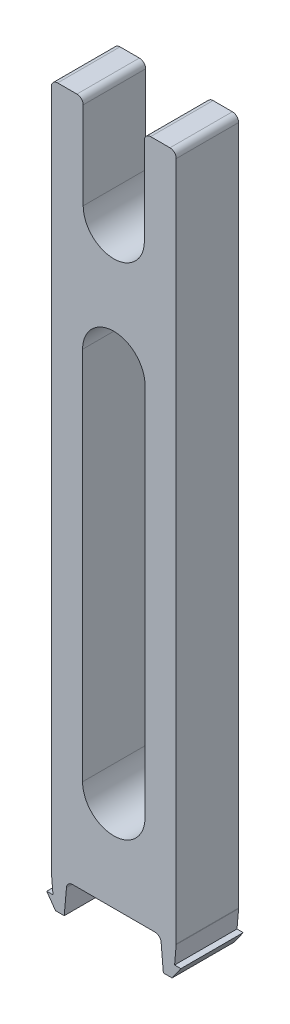
ISO-10303-21;
HEADER;
FILE_DESCRIPTION(('STEP AP214'),'2;1');
FILE_NAME('part.step','',(''),(''),'','','');
FILE_SCHEMA(('AUTOMOTIVE_DESIGN { 1 0 10303 214 1 1 1 1 }'));
ENDSEC;
DATA;
#1=APPLICATION_CONTEXT('core data for automotive mechanical design processes');
#2=APPLICATION_PROTOCOL_DEFINITION('international standard','automotive_design',2000,#1);
#3=PRODUCT_CONTEXT('',#1,'mechanical');
#4=PRODUCT('Part','Part','',(#3));
#5=PRODUCT_RELATED_PRODUCT_CATEGORY('part','',(#4));
#6=PRODUCT_DEFINITION_FORMATION('','',#4);
#7=PRODUCT_DEFINITION_CONTEXT('part definition',#1,'design');
#8=PRODUCT_DEFINITION('design','',#6,#7);
#9=PRODUCT_DEFINITION_SHAPE('','',#8);
#10=(LENGTH_UNIT() NAMED_UNIT(*) SI_UNIT(.MILLI.,.METRE.));
#11=(NAMED_UNIT(*) PLANE_ANGLE_UNIT() SI_UNIT($,.RADIAN.));
#12=(NAMED_UNIT(*) SI_UNIT($,.STERADIAN.) SOLID_ANGLE_UNIT());
#13=UNCERTAINTY_MEASURE_WITH_UNIT(LENGTH_MEASURE(1.E-05),#10,'distance_accuracy_value','');
#14=(GEOMETRIC_REPRESENTATION_CONTEXT(3) GLOBAL_UNCERTAINTY_ASSIGNED_CONTEXT((#13)) GLOBAL_UNIT_ASSIGNED_CONTEXT((#10,
#11,#12)) REPRESENTATION_CONTEXT('',''));
#15=CARTESIAN_POINT('',(0.,0.,0.));
#16=DIRECTION('',(0.,0.,1.));
#17=DIRECTION('',(1.,0.,0.));
#18=AXIS2_PLACEMENT_3D('',#15,#16,#17);
#19=CARTESIAN_POINT('',(0.,0.,0.));
#20=DIRECTION('',(0.,1.,0.));
#21=DIRECTION('',(0.,0.,1.));
#22=AXIS2_PLACEMENT_3D('',#19,#20,#21);
#23=PLANE('',#22);
#24=DIRECTION('',(-1.,0.,0.));
#25=VECTOR('',#24,1.);
#26=CARTESIAN_POINT('',(10.,0.,-5.));
#27=LINE('',#26,#25);
#28=CARTESIAN_POINT('',(6.58366882598258,0.,-5.));
#29=VERTEX_POINT('',#28);
#30=CARTESIAN_POINT('',(-6.58366882598258,0.,-5.));
#31=VERTEX_POINT('',#30);
#32=EDGE_CURVE('E374',#29,#31,#27,.T.);
#33=ORIENTED_EDGE('',*,*,#32,.F.);
#34=DIRECTION('',(0.,0.,1.));
#35=VECTOR('',#34,1.);
#36=CARTESIAN_POINT('',(6.58366882598258,0.,5.));
#37=LINE('',#36,#35);
#38=CARTESIAN_POINT('',(6.58366882598258,0.,5.));
#39=VERTEX_POINT('',#38);
#40=EDGE_CURVE('E422',#29,#39,#37,.T.);
#41=ORIENTED_EDGE('',*,*,#40,.T.);
#42=DIRECTION('',(1.,0.,0.));
#43=VECTOR('',#42,1.);
#44=CARTESIAN_POINT('',(10.,0.,5.));
#45=LINE('',#44,#43);
#46=CARTESIAN_POINT('',(-6.58366882598258,0.,5.));
#47=VERTEX_POINT('',#46);
#48=EDGE_CURVE('E364',#47,#39,#45,.T.);
#49=ORIENTED_EDGE('',*,*,#48,.F.);
#50=DIRECTION('',(0.,0.,1.));
#51=VECTOR('',#50,1.);
#52=CARTESIAN_POINT('',(-6.58366882598258,0.,0.));
#53=LINE('',#52,#51);
#54=EDGE_CURVE('E420',#47,#31,#53,.F.);
#55=ORIENTED_EDGE('',*,*,#54,.T.);
#56=EDGE_LOOP('',(#33,#41,#49,#55));
#57=FACE_BOUND('',#56,.T.);
#58=ADVANCED_FACE('F44',(#57),#23,.F.);
#59=CARTESIAN_POINT('',(0.,110.,0.));
#60=DIRECTION('',(0.,1.,0.));
#61=DIRECTION('',(0.,0.,1.));
#62=AXIS2_PLACEMENT_3D('',#59,#60,#61);
#63=PLANE('',#62);
#64=DIRECTION('',(1.,0.,0.));
#65=VECTOR('',#64,1.);
#66=CARTESIAN_POINT('',(10.,110.,5.));
#67=LINE('',#66,#65);
#68=CARTESIAN_POINT('',(5.9,110.,5.));
#69=VERTEX_POINT('',#68);
#70=CARTESIAN_POINT('',(9.00000000000001,110.,5.));
#71=VERTEX_POINT('',#70);
#72=EDGE_CURVE('E369',#69,#71,#67,.T.);
#73=ORIENTED_EDGE('',*,*,#72,.T.);
#74=DIRECTION('',(0.,0.,-1.));
#75=VECTOR('',#74,1.);
#76=CARTESIAN_POINT('',(9.00000000000001,110.,-5.));
#77=LINE('',#76,#75);
#78=CARTESIAN_POINT('',(9.00000000000001,110.,-5.));
#79=VERTEX_POINT('',#78);
#80=EDGE_CURVE('E439',#71,#79,#77,.T.);
#81=ORIENTED_EDGE('',*,*,#80,.T.);
#82=DIRECTION('',(-1.,0.,0.));
#83=VECTOR('',#82,1.);
#84=CARTESIAN_POINT('',(10.,110.,-5.));
#85=LINE('',#84,#83);
#86=CARTESIAN_POINT('',(5.9,110.,-5.));
#87=VERTEX_POINT('',#86);
#88=EDGE_CURVE('E372',#79,#87,#85,.T.);
#89=ORIENTED_EDGE('',*,*,#88,.T.);
#90=DIRECTION('',(0.,0.,1.));
#91=VECTOR('',#90,1.);
#92=CARTESIAN_POINT('',(5.9,110.,5.));
#93=LINE('',#92,#91);
#94=EDGE_CURVE('E436',#87,#69,#93,.T.);
#95=ORIENTED_EDGE('',*,*,#94,.T.);
#96=EDGE_LOOP('',(#73,#81,#89,#95));
#97=FACE_BOUND('',#96,.T.);
#98=ADVANCED_FACE('F534',(#97),#63,.T.);
#99=CARTESIAN_POINT('',(-10.,110.,5.));
#100=DIRECTION('',(1.,0.,0.));
#101=DIRECTION('',(0.,0.,-1.));
#102=AXIS2_PLACEMENT_3D('',#99,#100,#101);
#103=PLANE('',#102);
#104=DIRECTION('',(0.,-1.,0.));
#105=VECTOR('',#104,1.);
#106=CARTESIAN_POINT('',(-10.,110.,-5.));
#107=LINE('',#106,#105);
#108=CARTESIAN_POINT('',(-10.,109.,-5.));
#109=VERTEX_POINT('',#108);
#110=CARTESIAN_POINT('',(-10.,0.0436609429084883,-5.));
#111=VERTEX_POINT('',#110);
#112=EDGE_CURVE('E377',#109,#111,#107,.T.);
#113=ORIENTED_EDGE('',*,*,#112,.T.);
#114=DIRECTION('',(0.,0.,1.));
#115=VECTOR('',#114,1.);
#116=CARTESIAN_POINT('',(-10.,0.0436609429084883,5.));
#117=LINE('',#116,#115);
#118=CARTESIAN_POINT('',(-10.,0.0436609429084883,5.));
#119=VERTEX_POINT('',#118);
#120=EDGE_CURVE('E431',#111,#119,#117,.T.);
#121=ORIENTED_EDGE('',*,*,#120,.T.);
#122=DIRECTION('',(0.,-1.,0.));
#123=VECTOR('',#122,1.);
#124=CARTESIAN_POINT('',(-10.,110.,5.));
#125=LINE('',#124,#123);
#126=CARTESIAN_POINT('',(-10.,109.,5.));
#127=VERTEX_POINT('',#126);
#128=EDGE_CURVE('E386',#127,#119,#125,.T.);
#129=ORIENTED_EDGE('',*,*,#128,.F.);
#130=DIRECTION('',(0.,0.,1.));
#131=VECTOR('',#130,1.);
#132=CARTESIAN_POINT('',(-10.,109.,-5.));
#133=LINE('',#132,#131);
#134=EDGE_CURVE('E429',#127,#109,#133,.F.);
#135=ORIENTED_EDGE('',*,*,#134,.T.);
#136=EDGE_LOOP('',(#113,#121,#129,#135));
#137=FACE_BOUND('',#136,.T.);
#138=ADVANCED_FACE('F496',(#137),#103,.F.);
#139=CARTESIAN_POINT('',(10.,110.,5.));
#140=DIRECTION('',(0.,0.,-1.));
#141=DIRECTION('',(-1.,0.,0.));
#142=AXIS2_PLACEMENT_3D('',#139,#140,#141);
#143=PLANE('',#142);
#144=DIRECTION('',(0.,1.,0.));
#145=VECTOR('',#144,1.);
#146=CARTESIAN_POINT('',(5.,0.,5.));
#147=LINE('',#146,#145);
#148=CARTESIAN_POINT('',(5.,15.05,5.));
#149=VERTEX_POINT('',#148);
#150=CARTESIAN_POINT('',(5.,75.05,5.));
#151=VERTEX_POINT('',#150);
#152=EDGE_CURVE('E326',#149,#151,#147,.T.);
#153=ORIENTED_EDGE('',*,*,#152,.F.);
#154=CARTESIAN_POINT('',(0.,15.05,5.));
#155=DIRECTION('',(0.,0.,1.));
#156=DIRECTION('',(1.,0.,0.));
#157=AXIS2_PLACEMENT_3D('',#154,#155,#156);
#158=CIRCLE('',#157,5.);
#159=CARTESIAN_POINT('',(-5.,15.05,5.));
#160=VERTEX_POINT('',#159);
#161=EDGE_CURVE('E292',#160,#149,#158,.T.);
#162=ORIENTED_EDGE('',*,*,#161,.F.);
#163=DIRECTION('',(0.,1.,0.));
#164=VECTOR('',#163,1.);
#165=CARTESIAN_POINT('',(-5.,0.,5.));
#166=LINE('',#165,#164);
#167=CARTESIAN_POINT('',(-5.,75.05,5.));
#168=VERTEX_POINT('',#167);
#169=EDGE_CURVE('E332',#160,#168,#166,.T.);
#170=ORIENTED_EDGE('',*,*,#169,.T.);
#171=CARTESIAN_POINT('',(0.,75.05,5.));
#172=DIRECTION('',(0.,0.,1.));
#173=DIRECTION('',(1.,0.,0.));
#174=AXIS2_PLACEMENT_3D('',#171,#172,#173);
#175=CIRCLE('',#174,5.);
#176=EDGE_CURVE('E329',#168,#151,#175,.F.);
#177=ORIENTED_EDGE('',*,*,#176,.T.);
#178=EDGE_LOOP('',(#153,#162,#170,#177));
#179=FACE_BOUND('',#178,.T.);
#180=DIRECTION('',(-0.0871557427476617,-0.996194698091745,0.));
#181=VECTOR('',#180,1.);
#182=CARTESIAN_POINT('',(9.73753400942222,-3.,5.));
#183=LINE('',#182,#181);
#184=CARTESIAN_POINT('',(9.99619469809175,-0.0434947998390902,5.));
#185=VERTEX_POINT('',#184);
#186=CARTESIAN_POINT('',(9.73753400942222,-3.,5.));
#187=VERTEX_POINT('',#186);
#188=EDGE_CURVE('E250',#185,#187,#183,.T.);
#189=ORIENTED_EDGE('',*,*,#188,.F.);
#190=CARTESIAN_POINT('',(9.00000000000001,0.0436609429085716,5.));
#191=DIRECTION('',(0.,0.,-1.));
#192=DIRECTION('',(-1.,0.,0.));
#193=AXIS2_PLACEMENT_3D('',#190,#191,#192);
#194=CIRCLE('',#193,1.);
#195=CARTESIAN_POINT('',(10.,0.0436609429085716,5.));
#196=VERTEX_POINT('',#195);
#197=EDGE_CURVE('E418',#185,#196,#194,.F.);
#198=ORIENTED_EDGE('',*,*,#197,.T.);
#199=DIRECTION('',(0.,-1.,0.));
#200=VECTOR('',#199,1.);
#201=CARTESIAN_POINT('',(10.,110.,5.));
#202=LINE('',#201,#200);
#203=CARTESIAN_POINT('',(10.,109.,5.));
#204=VERTEX_POINT('',#203);
#205=EDGE_CURVE('E383',#204,#196,#202,.T.);
#206=ORIENTED_EDGE('',*,*,#205,.F.);
#207=CARTESIAN_POINT('',(9.00000000000001,109.,5.));
#208=DIRECTION('',(0.,0.,-1.));
#209=DIRECTION('',(-1.,0.,0.));
#210=AXIS2_PLACEMENT_3D('',#207,#208,#209);
#211=CIRCLE('',#210,1.);
#212=EDGE_CURVE('E414',#204,#71,#211,.F.);
#213=ORIENTED_EDGE('',*,*,#212,.T.);
#214=ORIENTED_EDGE('',*,*,#72,.F.);
#215=CARTESIAN_POINT('',(5.9,109.,5.));
#216=DIRECTION('',(0.,0.,-1.));
#217=DIRECTION('',(-1.,0.,0.));
#218=AXIS2_PLACEMENT_3D('',#215,#216,#217);
#219=CIRCLE('',#218,1.);
#220=CARTESIAN_POINT('',(4.9,109.,5.));
#221=VERTEX_POINT('',#220);
#222=EDGE_CURVE('E412',#69,#221,#219,.F.);
#223=ORIENTED_EDGE('',*,*,#222,.T.);
#224=DIRECTION('',(0.,1.,0.));
#225=VECTOR('',#224,1.);
#226=CARTESIAN_POINT('',(4.90000000000001,95.,5.));
#227=LINE('',#226,#225);
#228=CARTESIAN_POINT('',(4.90000000000001,95.,5.));
#229=VERTEX_POINT('',#228);
#230=EDGE_CURVE('E355',#229,#221,#227,.T.);
#231=ORIENTED_EDGE('',*,*,#230,.F.);
#232=CARTESIAN_POINT('',(0.,95.,5.));
#233=DIRECTION('',(0.,0.,1.));
#234=DIRECTION('',(1.,0.,0.));
#235=AXIS2_PLACEMENT_3D('',#232,#233,#234);
#236=CIRCLE('',#235,4.9);
#237=CARTESIAN_POINT('',(-4.89999999999999,95.,5.));
#238=VERTEX_POINT('',#237);
#239=EDGE_CURVE('E352',#238,#229,#236,.T.);
#240=ORIENTED_EDGE('',*,*,#239,.F.);
#241=DIRECTION('',(0.,-1.,0.));
#242=VECTOR('',#241,1.);
#243=CARTESIAN_POINT('',(-4.9,110.,5.));
#244=LINE('',#243,#242);
#245=CARTESIAN_POINT('',(-4.9,109.,5.));
#246=VERTEX_POINT('',#245);
#247=EDGE_CURVE('E344',#246,#238,#244,.T.);
#248=ORIENTED_EDGE('',*,*,#247,.F.);
#249=CARTESIAN_POINT('',(-5.9,109.,5.));
#250=DIRECTION('',(0.,0.,-1.));
#251=DIRECTION('',(-1.,0.,0.));
#252=AXIS2_PLACEMENT_3D('',#249,#250,#251);
#253=CIRCLE('',#252,1.);
#254=CARTESIAN_POINT('',(-5.9,110.,5.));
#255=VERTEX_POINT('',#254);
#256=EDGE_CURVE('E410',#246,#255,#253,.F.);
#257=ORIENTED_EDGE('',*,*,#256,.T.);
#258=CARTESIAN_POINT('',(-9.,110.,5.));
#259=VERTEX_POINT('',#258);
#260=EDGE_CURVE('E365',#259,#255,#67,.T.);
#261=ORIENTED_EDGE('',*,*,#260,.F.);
#262=CARTESIAN_POINT('',(-9.,109.,5.));
#263=DIRECTION('',(0.,0.,-1.));
#264=DIRECTION('',(-1.,0.,0.));
#265=AXIS2_PLACEMENT_3D('',#262,#263,#264);
#266=CIRCLE('',#265,1.);
#267=EDGE_CURVE('E408',#259,#127,#266,.F.);
#268=ORIENTED_EDGE('',*,*,#267,.T.);
#269=ORIENTED_EDGE('',*,*,#128,.T.);
#270=CARTESIAN_POINT('',(-9.,0.0436609429084883,5.));
#271=DIRECTION('',(0.,0.,-1.));
#272=DIRECTION('',(-1.,0.,0.));
#273=AXIS2_PLACEMENT_3D('',#270,#271,#272);
#274=CIRCLE('',#273,1.);
#275=CARTESIAN_POINT('',(-9.99619469809174,-0.0434947998391739,5.));
#276=VERTEX_POINT('',#275);
#277=EDGE_CURVE('E416',#119,#276,#274,.F.);
#278=ORIENTED_EDGE('',*,*,#277,.T.);
#279=DIRECTION('',(0.0871557427476617,-0.996194698091745,0.));
#280=VECTOR('',#279,1.);
#281=CARTESIAN_POINT('',(-9.73753400942222,-3.,5.));
#282=LINE('',#281,#280);
#283=CARTESIAN_POINT('',(-9.73753400942222,-3.,5.));
#284=VERTEX_POINT('',#283);
#285=EDGE_CURVE('E296',#276,#284,#282,.T.);
#286=ORIENTED_EDGE('',*,*,#285,.T.);
#287=DIRECTION('',(-1.,0.,0.));
#288=VECTOR('',#287,1.);
#289=CARTESIAN_POINT('',(-10.7375340094222,-3.,5.));
#290=LINE('',#289,#288);
#291=CARTESIAN_POINT('',(-10.7375340094222,-3.,5.));
#292=VERTEX_POINT('',#291);
#293=EDGE_CURVE('E298',#284,#292,#290,.T.);
#294=ORIENTED_EDGE('',*,*,#293,.T.);
#295=DIRECTION('',(0.573534726884144,-0.819181247989681,0.));
#296=VECTOR('',#295,1.);
#297=CARTESIAN_POINT('',(-9.33727068969503,-5.,5.));
#298=LINE('',#297,#296);
#299=CARTESIAN_POINT('',(-9.33727068969503,-5.,5.));
#300=VERTEX_POINT('',#299);
#301=EDGE_CURVE('E301',#292,#300,#298,.T.);
#302=ORIENTED_EDGE('',*,*,#301,.T.);
#303=DIRECTION('',(1.,0.,0.));
#304=VECTOR('',#303,1.);
#305=CARTESIAN_POINT('',(-7.93744331762964,-5.,5.));
#306=LINE('',#305,#304);
#307=CARTESIAN_POINT('',(-7.93744331762964,-5.,5.));
#308=VERTEX_POINT('',#307);
#309=EDGE_CURVE('E304',#300,#308,#306,.T.);
#310=ORIENTED_EDGE('',*,*,#309,.T.);
#311=DIRECTION('',(0.0871557427476621,0.996194698091745,0.));
#312=VECTOR('',#311,1.);
#313=CARTESIAN_POINT('',(-7.5,0.,5.));
#314=LINE('',#313,#312);
#315=CARTESIAN_POINT('',(-7.57986352407432,-0.912844257252338,5.));
#316=VERTEX_POINT('',#315);
#317=EDGE_CURVE('E293',#308,#316,#314,.T.);
#318=ORIENTED_EDGE('',*,*,#317,.T.);
#319=CARTESIAN_POINT('',(-6.58366882598258,-1.,5.));
#320=DIRECTION('',(0.,0.,-1.));
#321=DIRECTION('',(-1.,0.,0.));
#322=AXIS2_PLACEMENT_3D('',#319,#320,#321);
#323=CIRCLE('',#322,1.);
#324=EDGE_CURVE('E52',#316,#47,#323,.T.);
#325=ORIENTED_EDGE('',*,*,#324,.T.);
#326=ORIENTED_EDGE('',*,*,#48,.T.);
#327=CARTESIAN_POINT('',(6.58366882598258,-1.,5.));
#328=DIRECTION('',(0.,0.,-1.));
#329=DIRECTION('',(-1.,0.,0.));
#330=AXIS2_PLACEMENT_3D('',#327,#328,#329);
#331=CIRCLE('',#330,1.);
#332=CARTESIAN_POINT('',(7.57986352407432,-0.912844257252338,5.));
#333=VERTEX_POINT('',#332);
#334=EDGE_CURVE('E59',#39,#333,#331,.T.);
#335=ORIENTED_EDGE('',*,*,#334,.T.);
#336=DIRECTION('',(-0.0871557427476621,0.996194698091745,0.));
#337=VECTOR('',#336,1.);
#338=CARTESIAN_POINT('',(7.5,0.,5.));
#339=LINE('',#338,#337);
#340=CARTESIAN_POINT('',(7.93744331762964,-5.,5.));
#341=VERTEX_POINT('',#340);
#342=EDGE_CURVE('E243',#341,#333,#339,.T.);
#343=ORIENTED_EDGE('',*,*,#342,.F.);
#344=DIRECTION('',(-1.,0.,0.));
#345=VECTOR('',#344,1.);
#346=CARTESIAN_POINT('',(7.93744331762964,-5.,5.));
#347=LINE('',#346,#345);
#348=CARTESIAN_POINT('',(9.33727068969503,-5.,5.));
#349=VERTEX_POINT('',#348);
#350=EDGE_CURVE('E253',#349,#341,#347,.T.);
#351=ORIENTED_EDGE('',*,*,#350,.F.);
#352=DIRECTION('',(-0.573534726884144,-0.819181247989681,0.));
#353=VECTOR('',#352,1.);
#354=CARTESIAN_POINT('',(9.33727068969503,-5.,5.));
#355=LINE('',#354,#353);
#356=CARTESIAN_POINT('',(10.7375340094222,-3.,5.));
#357=VERTEX_POINT('',#356);
#358=EDGE_CURVE('E258',#357,#349,#355,.T.);
#359=ORIENTED_EDGE('',*,*,#358,.F.);
#360=DIRECTION('',(1.,0.,0.));
#361=VECTOR('',#360,1.);
#362=CARTESIAN_POINT('',(10.7375340094222,-3.,5.));
#363=LINE('',#362,#361);
#364=EDGE_CURVE('E267',#187,#357,#363,.T.);
#365=ORIENTED_EDGE('',*,*,#364,.F.);
#366=EDGE_LOOP('',(#189,#198,#206,#213,#214,#223,#231,#240,#248,#257,#261,#268,#269,#278,#286,
#294,#302,#310,#318,#325,#326,#335,#343,#351,#359,#365));
#367=FACE_BOUND('',#366,.T.);
#368=ADVANCED_FACE('F261',(#179,#367),#143,.F.);
#369=CARTESIAN_POINT('',(10.,110.,5.));
#370=DIRECTION('',(-1.,0.,0.));
#371=DIRECTION('',(0.,0.,1.));
#372=AXIS2_PLACEMENT_3D('',#369,#370,#371);
#373=PLANE('',#372);
#374=ORIENTED_EDGE('',*,*,#205,.T.);
#375=DIRECTION('',(0.,0.,-1.));
#376=VECTOR('',#375,1.);
#377=CARTESIAN_POINT('',(10.,0.0436609429085716,5.));
#378=LINE('',#377,#376);
#379=CARTESIAN_POINT('',(10.,0.0436609429085716,-5.));
#380=VERTEX_POINT('',#379);
#381=EDGE_CURVE('E391',#196,#380,#378,.T.);
#382=ORIENTED_EDGE('',*,*,#381,.T.);
#383=DIRECTION('',(0.,-1.,0.));
#384=VECTOR('',#383,1.);
#385=CARTESIAN_POINT('',(10.,110.,-5.));
#386=LINE('',#385,#384);
#387=CARTESIAN_POINT('',(10.,109.,-5.));
#388=VERTEX_POINT('',#387);
#389=EDGE_CURVE('E380',#388,#380,#386,.T.);
#390=ORIENTED_EDGE('',*,*,#389,.F.);
#391=DIRECTION('',(0.,0.,-1.));
#392=VECTOR('',#391,1.);
#393=CARTESIAN_POINT('',(10.,109.,5.));
#394=LINE('',#393,#392);
#395=EDGE_CURVE('E389',#388,#204,#394,.F.);
#396=ORIENTED_EDGE('',*,*,#395,.T.);
#397=EDGE_LOOP('',(#374,#382,#390,#396));
#398=FACE_BOUND('',#397,.T.);
#399=ADVANCED_FACE('F542',(#398),#373,.F.);
#400=CARTESIAN_POINT('',(10.,110.,-5.));
#401=DIRECTION('',(0.,0.,1.));
#402=DIRECTION('',(1.,0.,0.));
#403=AXIS2_PLACEMENT_3D('',#400,#401,#402);
#404=PLANE('',#403);
#405=DIRECTION('',(0.,-1.,0.));
#406=VECTOR('',#405,1.);
#407=CARTESIAN_POINT('',(-5.,0.,-5.));
#408=LINE('',#407,#406);
#409=CARTESIAN_POINT('',(-5.,75.05,-5.));
#410=VERTEX_POINT('',#409);
#411=CARTESIAN_POINT('',(-5.,15.05,-5.));
#412=VERTEX_POINT('',#411);
#413=EDGE_CURVE('E318',#410,#412,#408,.T.);
#414=ORIENTED_EDGE('',*,*,#413,.T.);
#415=CARTESIAN_POINT('',(0.,15.05,-5.));
#416=DIRECTION('',(0.,0.,1.));
#417=DIRECTION('',(1.,0.,0.));
#418=AXIS2_PLACEMENT_3D('',#415,#416,#417);
#419=CIRCLE('',#418,5.);
#420=CARTESIAN_POINT('',(5.,15.05,-5.));
#421=VERTEX_POINT('',#420);
#422=EDGE_CURVE('E322',#421,#412,#419,.F.);
#423=ORIENTED_EDGE('',*,*,#422,.F.);
#424=DIRECTION('',(0.,-1.,0.));
#425=VECTOR('',#424,1.);
#426=CARTESIAN_POINT('',(5.,0.,-5.));
#427=LINE('',#426,#425);
#428=CARTESIAN_POINT('',(5.,75.05,-5.));
#429=VERTEX_POINT('',#428);
#430=EDGE_CURVE('E324',#429,#421,#427,.T.);
#431=ORIENTED_EDGE('',*,*,#430,.F.);
#432=CARTESIAN_POINT('',(0.,75.05,-5.));
#433=DIRECTION('',(0.,0.,1.));
#434=DIRECTION('',(1.,0.,0.));
#435=AXIS2_PLACEMENT_3D('',#432,#433,#434);
#436=CIRCLE('',#435,5.);
#437=EDGE_CURVE('E315',#429,#410,#436,.T.);
#438=ORIENTED_EDGE('',*,*,#437,.T.);
#439=EDGE_LOOP('',(#414,#423,#431,#438));
#440=FACE_BOUND('',#439,.T.);
#441=ORIENTED_EDGE('',*,*,#389,.T.);
#442=CARTESIAN_POINT('',(9.00000000000001,0.0436609429085716,-5.));
#443=DIRECTION('',(0.,0.,1.));
#444=DIRECTION('',(1.,0.,0.));
#445=AXIS2_PLACEMENT_3D('',#442,#443,#444);
#446=CIRCLE('',#445,1.);
#447=CARTESIAN_POINT('',(9.99619469809175,-0.0434947998390902,-5.));
#448=VERTEX_POINT('',#447);
#449=EDGE_CURVE('E404',#380,#448,#446,.F.);
#450=ORIENTED_EDGE('',*,*,#449,.T.);
#451=DIRECTION('',(0.0871557427476617,0.996194698091745,0.));
#452=VECTOR('',#451,1.);
#453=CARTESIAN_POINT('',(9.73753400942222,-3.,-5.));
#454=LINE('',#453,#452);
#455=CARTESIAN_POINT('',(9.73753400942222,-3.,-5.));
#456=VERTEX_POINT('',#455);
#457=EDGE_CURVE('E550',#456,#448,#454,.T.);
#458=ORIENTED_EDGE('',*,*,#457,.F.);
#459=DIRECTION('',(-1.,0.,0.));
#460=VECTOR('',#459,1.);
#461=CARTESIAN_POINT('',(10.7375340094222,-3.,-5.));
#462=LINE('',#461,#460);
#463=CARTESIAN_POINT('',(10.7375340094222,-3.,-5.));
#464=VERTEX_POINT('',#463);
#465=EDGE_CURVE('E555',#464,#456,#462,.T.);
#466=ORIENTED_EDGE('',*,*,#465,.F.);
#467=DIRECTION('',(0.573534726884144,0.819181247989681,0.));
#468=VECTOR('',#467,1.);
#469=CARTESIAN_POINT('',(9.33727068969503,-5.,-5.));
#470=LINE('',#469,#468);
#471=CARTESIAN_POINT('',(9.33727068969503,-5.,-5.));
#472=VERTEX_POINT('',#471);
#473=EDGE_CURVE('E279',#472,#464,#470,.T.);
#474=ORIENTED_EDGE('',*,*,#473,.F.);
#475=DIRECTION('',(1.,0.,0.));
#476=VECTOR('',#475,1.);
#477=CARTESIAN_POINT('',(7.93744331762964,-5.,-5.));
#478=LINE('',#477,#476);
#479=CARTESIAN_POINT('',(7.93744331762964,-5.,-5.));
#480=VERTEX_POINT('',#479);
#481=EDGE_CURVE('E274',#480,#472,#478,.T.);
#482=ORIENTED_EDGE('',*,*,#481,.F.);
#483=DIRECTION('',(0.0871557427476621,-0.996194698091745,0.));
#484=VECTOR('',#483,1.);
#485=CARTESIAN_POINT('',(7.5,0.,-5.));
#486=LINE('',#485,#484);
#487=CARTESIAN_POINT('',(7.57986352407432,-0.912844257252338,-5.));
#488=VERTEX_POINT('',#487);
#489=EDGE_CURVE('E245',#488,#480,#486,.T.);
#490=ORIENTED_EDGE('',*,*,#489,.F.);
#491=CARTESIAN_POINT('',(6.58366882598258,-1.,-5.));
#492=DIRECTION('',(0.,0.,1.));
#493=DIRECTION('',(1.,0.,0.));
#494=AXIS2_PLACEMENT_3D('',#491,#492,#493);
#495=CIRCLE('',#494,1.);
#496=EDGE_CURVE('E453',#488,#29,#495,.T.);
#497=ORIENTED_EDGE('',*,*,#496,.T.);
#498=ORIENTED_EDGE('',*,*,#32,.T.);
#499=CARTESIAN_POINT('',(-6.58366882598258,-1.,-5.));
#500=DIRECTION('',(0.,0.,1.));
#501=DIRECTION('',(1.,0.,0.));
#502=AXIS2_PLACEMENT_3D('',#499,#500,#501);
#503=CIRCLE('',#502,1.);
#504=CARTESIAN_POINT('',(-7.57986352407432,-0.912844257252338,-5.));
#505=VERTEX_POINT('',#504);
#506=EDGE_CURVE('E11',#31,#505,#503,.T.);
#507=ORIENTED_EDGE('',*,*,#506,.T.);
#508=DIRECTION('',(-0.087155742747662,-0.996194698091745,0.));
#509=VECTOR('',#508,1.);
#510=CARTESIAN_POINT('',(-7.5,0.,-5.));
#511=LINE('',#510,#509);
#512=CARTESIAN_POINT('',(-7.93744331762964,-5.,-5.));
#513=VERTEX_POINT('',#512);
#514=EDGE_CURVE('E290',#505,#513,#511,.T.);
#515=ORIENTED_EDGE('',*,*,#514,.T.);
#516=DIRECTION('',(-1.,0.,0.));
#517=VECTOR('',#516,1.);
#518=CARTESIAN_POINT('',(-7.93744331762964,-5.,-5.));
#519=LINE('',#518,#517);
#520=CARTESIAN_POINT('',(-9.33727068969503,-5.,-5.));
#521=VERTEX_POINT('',#520);
#522=EDGE_CURVE('E288',#513,#521,#519,.T.);
#523=ORIENTED_EDGE('',*,*,#522,.T.);
#524=DIRECTION('',(-0.573534726884144,0.819181247989681,0.));
#525=VECTOR('',#524,1.);
#526=CARTESIAN_POINT('',(-9.33727068969503,-5.,-5.));
#527=LINE('',#526,#525);
#528=CARTESIAN_POINT('',(-10.7375340094222,-3.,-5.));
#529=VERTEX_POINT('',#528);
#530=EDGE_CURVE('E286',#521,#529,#527,.T.);
#531=ORIENTED_EDGE('',*,*,#530,.T.);
#532=DIRECTION('',(1.,0.,0.));
#533=VECTOR('',#532,1.);
#534=CARTESIAN_POINT('',(-10.7375340094222,-3.,-5.));
#535=LINE('',#534,#533);
#536=CARTESIAN_POINT('',(-9.73753400942222,-3.,-5.));
#537=VERTEX_POINT('',#536);
#538=EDGE_CURVE('E283',#529,#537,#535,.T.);
#539=ORIENTED_EDGE('',*,*,#538,.T.);
#540=DIRECTION('',(-0.0871557427476617,0.996194698091745,0.));
#541=VECTOR('',#540,1.);
#542=CARTESIAN_POINT('',(-9.73753400942222,-3.,-5.));
#543=LINE('',#542,#541);
#544=CARTESIAN_POINT('',(-9.99619469809174,-0.0434947998391739,-5.));
#545=VERTEX_POINT('',#544);
#546=EDGE_CURVE('E280',#537,#545,#543,.T.);
#547=ORIENTED_EDGE('',*,*,#546,.T.);
#548=CARTESIAN_POINT('',(-9.,0.0436609429084883,-5.));
#549=DIRECTION('',(0.,0.,1.));
#550=DIRECTION('',(1.,0.,0.));
#551=AXIS2_PLACEMENT_3D('',#548,#549,#550);
#552=CIRCLE('',#551,1.);
#553=EDGE_CURVE('E402',#545,#111,#552,.F.);
#554=ORIENTED_EDGE('',*,*,#553,.T.);
#555=ORIENTED_EDGE('',*,*,#112,.F.);
#556=CARTESIAN_POINT('',(-9.,109.,-5.));
#557=DIRECTION('',(0.,0.,1.));
#558=DIRECTION('',(1.,0.,0.));
#559=AXIS2_PLACEMENT_3D('',#556,#557,#558);
#560=CIRCLE('',#559,1.);
#561=CARTESIAN_POINT('',(-9.,110.,-5.));
#562=VERTEX_POINT('',#561);
#563=EDGE_CURVE('E394',#109,#562,#560,.F.);
#564=ORIENTED_EDGE('',*,*,#563,.T.);
#565=CARTESIAN_POINT('',(-5.9,110.,-5.));
#566=VERTEX_POINT('',#565);
#567=EDGE_CURVE('E368',#566,#562,#85,.T.);
#568=ORIENTED_EDGE('',*,*,#567,.F.);
#569=CARTESIAN_POINT('',(-5.9,109.,-5.));
#570=DIRECTION('',(0.,0.,1.));
#571=DIRECTION('',(1.,0.,0.));
#572=AXIS2_PLACEMENT_3D('',#569,#570,#571);
#573=CIRCLE('',#572,1.);
#574=CARTESIAN_POINT('',(-4.9,109.,-5.));
#575=VERTEX_POINT('',#574);
#576=EDGE_CURVE('E396',#566,#575,#573,.F.);
#577=ORIENTED_EDGE('',*,*,#576,.T.);
#578=DIRECTION('',(0.,1.,0.));
#579=VECTOR('',#578,1.);
#580=CARTESIAN_POINT('',(-4.9,110.,-5.));
#581=LINE('',#580,#579);
#582=CARTESIAN_POINT('',(-4.89999999999999,95.,-5.));
#583=VERTEX_POINT('',#582);
#584=EDGE_CURVE('E350',#583,#575,#581,.T.);
#585=ORIENTED_EDGE('',*,*,#584,.F.);
#586=CARTESIAN_POINT('',(0.,95.,-5.));
#587=DIRECTION('',(0.,0.,1.));
#588=DIRECTION('',(1.,0.,0.));
#589=AXIS2_PLACEMENT_3D('',#586,#587,#588);
#590=CIRCLE('',#589,4.9);
#591=CARTESIAN_POINT('',(4.90000000000001,95.,-5.));
#592=VERTEX_POINT('',#591);
#593=EDGE_CURVE('E345',#592,#583,#590,.F.);
#594=ORIENTED_EDGE('',*,*,#593,.F.);
#595=DIRECTION('',(0.,-1.,0.));
#596=VECTOR('',#595,1.);
#597=CARTESIAN_POINT('',(4.90000000000001,95.,-5.));
#598=LINE('',#597,#596);
#599=CARTESIAN_POINT('',(4.9,109.,-5.));
#600=VERTEX_POINT('',#599);
#601=EDGE_CURVE('E347',#600,#592,#598,.T.);
#602=ORIENTED_EDGE('',*,*,#601,.F.);
#603=CARTESIAN_POINT('',(5.9,109.,-5.));
#604=DIRECTION('',(0.,0.,1.));
#605=DIRECTION('',(1.,0.,0.));
#606=AXIS2_PLACEMENT_3D('',#603,#604,#605);
#607=CIRCLE('',#606,1.);
#608=EDGE_CURVE('E398',#600,#87,#607,.F.);
#609=ORIENTED_EDGE('',*,*,#608,.T.);
#610=ORIENTED_EDGE('',*,*,#88,.F.);
#611=CARTESIAN_POINT('',(9.00000000000001,109.,-5.));
#612=DIRECTION('',(0.,0.,1.));
#613=DIRECTION('',(1.,0.,0.));
#614=AXIS2_PLACEMENT_3D('',#611,#612,#613);
#615=CIRCLE('',#614,1.);
#616=EDGE_CURVE('E400',#79,#388,#615,.F.);
#617=ORIENTED_EDGE('',*,*,#616,.T.);
#618=EDGE_LOOP('',(#441,#450,#458,#466,#474,#482,#490,#497,#498,#507,#515,#523,#531,#539,#547,
#554,#555,#564,#568,#577,#585,#594,#602,#609,#610,#617));
#619=FACE_BOUND('',#618,.T.);
#620=ADVANCED_FACE('F465',(#440,#619),#404,.F.);
#621=ORIENTED_EDGE('',*,*,#260,.T.);
#622=DIRECTION('',(0.,0.,1.));
#623=VECTOR('',#622,1.);
#624=CARTESIAN_POINT('',(-5.9,110.,-5.));
#625=LINE('',#624,#623);
#626=EDGE_CURVE('E450',#255,#566,#625,.F.);
#627=ORIENTED_EDGE('',*,*,#626,.T.);
#628=ORIENTED_EDGE('',*,*,#567,.T.);
#629=DIRECTION('',(0.,0.,1.));
#630=VECTOR('',#629,1.);
#631=CARTESIAN_POINT('',(-9.,110.,5.));
#632=LINE('',#631,#630);
#633=EDGE_CURVE('E447',#562,#259,#632,.T.);
#634=ORIENTED_EDGE('',*,*,#633,.T.);
#635=EDGE_LOOP('',(#621,#627,#628,#634));
#636=FACE_BOUND('',#635,.T.);
#637=ADVANCED_FACE('F504',(#636),#63,.T.);
#638=CARTESIAN_POINT('',(4.90000000000001,95.,-27.1822000712283));
#639=DIRECTION('',(1.,0.,0.));
#640=DIRECTION('',(0.,1.,0.));
#641=AXIS2_PLACEMENT_3D('',#638,#639,#640);
#642=PLANE('',#641);
#643=ORIENTED_EDGE('',*,*,#230,.T.);
#644=DIRECTION('',(0.,0.,1.));
#645=VECTOR('',#644,1.);
#646=CARTESIAN_POINT('',(4.9,109.,-5.));
#647=LINE('',#646,#645);
#648=EDGE_CURVE('E442',#221,#600,#647,.F.);
#649=ORIENTED_EDGE('',*,*,#648,.T.);
#650=ORIENTED_EDGE('',*,*,#601,.T.);
#651=DIRECTION('',(0.,0.,1.));
#652=VECTOR('',#651,1.);
#653=CARTESIAN_POINT('',(4.90000000000001,95.,-27.1822000712283));
#654=LINE('',#653,#652);
#655=EDGE_CURVE('E348',#592,#229,#654,.T.);
#656=ORIENTED_EDGE('',*,*,#655,.T.);
#657=EDGE_LOOP('',(#643,#649,#650,#656));
#658=FACE_BOUND('',#657,.T.);
#659=ADVANCED_FACE('F524',(#658),#642,.F.);
#660=CARTESIAN_POINT('',(0.,95.,-27.1822000712283));
#661=DIRECTION('',(0.,0.,1.));
#662=DIRECTION('',(1.,0.,0.));
#663=AXIS2_PLACEMENT_3D('',#660,#661,#662);
#664=CYLINDRICAL_SURFACE('',#663,4.9);
#665=ORIENTED_EDGE('',*,*,#593,.T.);
#666=DIRECTION('',(0.,0.,1.));
#667=VECTOR('',#666,1.);
#668=CARTESIAN_POINT('',(-4.89999999999999,95.,-27.1822000712283));
#669=LINE('',#668,#667);
#670=EDGE_CURVE('E358',#583,#238,#669,.T.);
#671=ORIENTED_EDGE('',*,*,#670,.T.);
#672=ORIENTED_EDGE('',*,*,#239,.T.);
#673=ORIENTED_EDGE('',*,*,#655,.F.);
#674=EDGE_LOOP('',(#665,#671,#672,#673));
#675=FACE_BOUND('',#674,.T.);
#676=ADVANCED_FACE('F518',(#675),#664,.F.);
#677=CARTESIAN_POINT('',(-4.9,110.,-27.1822000712283));
#678=DIRECTION('',(-1.,0.,0.));
#679=DIRECTION('',(0.,-1.,0.));
#680=AXIS2_PLACEMENT_3D('',#677,#678,#679);
#681=PLANE('',#680);
#682=ORIENTED_EDGE('',*,*,#584,.T.);
#683=DIRECTION('',(0.,0.,1.));
#684=VECTOR('',#683,1.);
#685=CARTESIAN_POINT('',(-4.9,109.,5.));
#686=LINE('',#685,#684);
#687=EDGE_CURVE('E444',#575,#246,#686,.T.);
#688=ORIENTED_EDGE('',*,*,#687,.T.);
#689=ORIENTED_EDGE('',*,*,#247,.T.);
#690=ORIENTED_EDGE('',*,*,#670,.F.);
#691=EDGE_LOOP('',(#682,#688,#689,#690));
#692=FACE_BOUND('',#691,.T.);
#693=ADVANCED_FACE('F514',(#692),#681,.F.);
#694=CARTESIAN_POINT('',(0.,15.05,-75.7106781186548));
#695=DIRECTION('',(0.,0.,1.));
#696=DIRECTION('',(1.,0.,0.));
#697=AXIS2_PLACEMENT_3D('',#694,#695,#696);
#698=CYLINDRICAL_SURFACE('',#697,5.);
#699=ORIENTED_EDGE('',*,*,#422,.T.);
#700=DIRECTION('',(0.,0.,1.));
#701=VECTOR('',#700,1.);
#702=CARTESIAN_POINT('',(-5.,15.05,-75.7106781186548));
#703=LINE('',#702,#701);
#704=EDGE_CURVE('E319',#412,#160,#703,.T.);
#705=ORIENTED_EDGE('',*,*,#704,.T.);
#706=ORIENTED_EDGE('',*,*,#161,.T.);
#707=DIRECTION('',(0.,0.,1.));
#708=VECTOR('',#707,1.);
#709=CARTESIAN_POINT('',(5.,15.05,-75.7106781186548));
#710=LINE('',#709,#708);
#711=EDGE_CURVE('E335',#421,#149,#710,.T.);
#712=ORIENTED_EDGE('',*,*,#711,.F.);
#713=EDGE_LOOP('',(#699,#705,#706,#712));
#714=FACE_BOUND('',#713,.T.);
#715=ADVANCED_FACE('F754',(#714),#698,.F.);
#716=CARTESIAN_POINT('',(-5.,0.,-75.7106781186548));
#717=DIRECTION('',(1.,0.,0.));
#718=DIRECTION('',(0.,0.,-1.));
#719=AXIS2_PLACEMENT_3D('',#716,#717,#718);
#720=PLANE('',#719);
#721=DIRECTION('',(0.,0.,1.));
#722=VECTOR('',#721,1.);
#723=CARTESIAN_POINT('',(-5.,75.05,-75.7106781186548));
#724=LINE('',#723,#722);
#725=EDGE_CURVE('E337',#410,#168,#724,.T.);
#726=ORIENTED_EDGE('',*,*,#725,.T.);
#727=ORIENTED_EDGE('',*,*,#169,.F.);
#728=ORIENTED_EDGE('',*,*,#704,.F.);
#729=ORIENTED_EDGE('',*,*,#413,.F.);
#730=EDGE_LOOP('',(#726,#727,#728,#729));
#731=FACE_BOUND('',#730,.T.);
#732=ADVANCED_FACE('F794',(#731),#720,.T.);
#733=CARTESIAN_POINT('',(0.,75.05,-75.7106781186548));
#734=DIRECTION('',(0.,0.,1.));
#735=DIRECTION('',(1.,0.,0.));
#736=AXIS2_PLACEMENT_3D('',#733,#734,#735);
#737=CYLINDRICAL_SURFACE('',#736,5.);
#738=DIRECTION('',(0.,0.,1.));
#739=VECTOR('',#738,1.);
#740=CARTESIAN_POINT('',(5.,75.05,-75.7106781186548));
#741=LINE('',#740,#739);
#742=EDGE_CURVE('E339',#429,#151,#741,.T.);
#743=ORIENTED_EDGE('',*,*,#742,.T.);
#744=ORIENTED_EDGE('',*,*,#176,.F.);
#745=ORIENTED_EDGE('',*,*,#725,.F.);
#746=ORIENTED_EDGE('',*,*,#437,.F.);
#747=EDGE_LOOP('',(#743,#744,#745,#746));
#748=FACE_BOUND('',#747,.T.);
#749=ADVANCED_FACE('F803',(#748),#737,.F.);
#750=CARTESIAN_POINT('',(5.,0.,-75.7106781186548));
#751=DIRECTION('',(1.,0.,0.));
#752=DIRECTION('',(0.,0.,-1.));
#753=AXIS2_PLACEMENT_3D('',#750,#751,#752);
#754=PLANE('',#753);
#755=ORIENTED_EDGE('',*,*,#430,.T.);
#756=ORIENTED_EDGE('',*,*,#711,.T.);
#757=ORIENTED_EDGE('',*,*,#152,.T.);
#758=ORIENTED_EDGE('',*,*,#742,.F.);
#759=EDGE_LOOP('',(#755,#756,#757,#758));
#760=FACE_BOUND('',#759,.T.);
#761=ADVANCED_FACE('F745',(#760),#754,.F.);
#762=CARTESIAN_POINT('',(-7.5,0.,-10.9566455713065));
#763=DIRECTION('',(0.996194698091745,-0.087155742747662,0.));
#764=DIRECTION('',(0.087155742747662,0.996194698091745,0.));
#765=AXIS2_PLACEMENT_3D('',#762,#763,#764);
#766=PLANE('',#765);
#767=ORIENTED_EDGE('',*,*,#514,.F.);
#768=DIRECTION('',(0.,0.,1.));
#769=VECTOR('',#768,1.);
#770=CARTESIAN_POINT('',(-7.57986352407432,-0.912844257252338,-10.9566455713065));
#771=LINE('',#770,#769);
#772=EDGE_CURVE('E426',#505,#316,#771,.T.);
#773=ORIENTED_EDGE('',*,*,#772,.T.);
#774=ORIENTED_EDGE('',*,*,#317,.F.);
#775=DIRECTION('',(0.,0.,1.));
#776=VECTOR('',#775,1.);
#777=CARTESIAN_POINT('',(-7.93744331762964,-5.,-10.9566455713065));
#778=LINE('',#777,#776);
#779=EDGE_CURVE('E284',#513,#308,#778,.T.);
#780=ORIENTED_EDGE('',*,*,#779,.F.);
#781=EDGE_LOOP('',(#767,#773,#774,#780));
#782=FACE_BOUND('',#781,.T.);
#783=ADVANCED_FACE('F469',(#782),#766,.T.);
#784=CARTESIAN_POINT('',(-7.93744331762964,-5.,-10.9566455713065));
#785=DIRECTION('',(0.,-1.,0.));
#786=DIRECTION('',(1.,0.,0.));
#787=AXIS2_PLACEMENT_3D('',#784,#785,#786);
#788=PLANE('',#787);
#789=ORIENTED_EDGE('',*,*,#522,.F.);
#790=ORIENTED_EDGE('',*,*,#779,.T.);
#791=ORIENTED_EDGE('',*,*,#309,.F.);
#792=DIRECTION('',(0.,0.,1.));
#793=VECTOR('',#792,1.);
#794=CARTESIAN_POINT('',(-9.33727068969503,-5.,-10.9566455713065));
#795=LINE('',#794,#793);
#796=EDGE_CURVE('E309',#521,#300,#795,.T.);
#797=ORIENTED_EDGE('',*,*,#796,.F.);
#798=EDGE_LOOP('',(#789,#790,#791,#797));
#799=FACE_BOUND('',#798,.T.);
#800=ADVANCED_FACE('F472',(#799),#788,.T.);
#801=CARTESIAN_POINT('',(-9.33727068969503,-5.,-10.9566455713065));
#802=DIRECTION('',(-0.81918124798968,-0.573534726884144,0.));
#803=DIRECTION('',(0.573534726884144,-0.819181247989681,0.));
#804=AXIS2_PLACEMENT_3D('',#801,#802,#803);
#805=PLANE('',#804);
#806=ORIENTED_EDGE('',*,*,#530,.F.);
#807=ORIENTED_EDGE('',*,*,#796,.T.);
#808=ORIENTED_EDGE('',*,*,#301,.F.);
#809=DIRECTION('',(0.,0.,1.));
#810=VECTOR('',#809,1.);
#811=CARTESIAN_POINT('',(-10.7375340094222,-3.,-10.9566455713065));
#812=LINE('',#811,#810);
#813=EDGE_CURVE('E311',#529,#292,#812,.T.);
#814=ORIENTED_EDGE('',*,*,#813,.F.);
#815=EDGE_LOOP('',(#806,#807,#808,#814));
#816=FACE_BOUND('',#815,.T.);
#817=ADVANCED_FACE('F478',(#816),#805,.T.);
#818=CARTESIAN_POINT('',(-10.7375340094222,-3.,-10.9566455713065));
#819=DIRECTION('',(0.,1.,0.));
#820=DIRECTION('',(0.,0.,1.));
#821=AXIS2_PLACEMENT_3D('',#818,#819,#820);
#822=PLANE('',#821);
#823=ORIENTED_EDGE('',*,*,#538,.F.);
#824=ORIENTED_EDGE('',*,*,#813,.T.);
#825=ORIENTED_EDGE('',*,*,#293,.F.);
#826=DIRECTION('',(0.,0.,1.));
#827=VECTOR('',#826,1.);
#828=CARTESIAN_POINT('',(-9.73753400942222,-3.,-10.9566455713065));
#829=LINE('',#828,#827);
#830=EDGE_CURVE('E307',#537,#284,#829,.T.);
#831=ORIENTED_EDGE('',*,*,#830,.F.);
#832=EDGE_LOOP('',(#823,#824,#825,#831));
#833=FACE_BOUND('',#832,.T.);
#834=ADVANCED_FACE('F482',(#833),#822,.T.);
#835=CARTESIAN_POINT('',(-9.73753400942222,-3.,-10.9566455713065));
#836=DIRECTION('',(-0.996194698091745,-0.0871557427476617,0.));
#837=DIRECTION('',(0.0871557427476617,-0.996194698091745,0.));
#838=AXIS2_PLACEMENT_3D('',#835,#836,#837);
#839=PLANE('',#838);
#840=ORIENTED_EDGE('',*,*,#285,.F.);
#841=DIRECTION('',(0.,0.,1.));
#842=VECTOR('',#841,1.);
#843=CARTESIAN_POINT('',(-9.99619469809174,-0.0434947998391734,-5.));
#844=LINE('',#843,#842);
#845=EDGE_CURVE('E434',#276,#545,#844,.F.);
#846=ORIENTED_EDGE('',*,*,#845,.T.);
#847=ORIENTED_EDGE('',*,*,#546,.F.);
#848=ORIENTED_EDGE('',*,*,#830,.T.);
#849=EDGE_LOOP('',(#840,#846,#847,#848));
#850=FACE_BOUND('',#849,.T.);
#851=ADVANCED_FACE('F488',(#850),#839,.T.);
#852=CARTESIAN_POINT('',(7.93744331762964,-5.,-10.9566455713065));
#853=DIRECTION('',(0.,1.,0.));
#854=DIRECTION('',(-1.,0.,0.));
#855=AXIS2_PLACEMENT_3D('',#852,#853,#854);
#856=PLANE('',#855);
#857=DIRECTION('',(0.,0.,1.));
#858=VECTOR('',#857,1.);
#859=CARTESIAN_POINT('',(7.93744331762964,-5.,-10.9566455713065));
#860=LINE('',#859,#858);
#861=EDGE_CURVE('E240',#480,#341,#860,.T.);
#862=ORIENTED_EDGE('',*,*,#861,.F.);
#863=ORIENTED_EDGE('',*,*,#481,.T.);
#864=DIRECTION('',(0.,0.,1.));
#865=VECTOR('',#864,1.);
#866=CARTESIAN_POINT('',(9.33727068969503,-5.,-10.9566455713065));
#867=LINE('',#866,#865);
#868=EDGE_CURVE('E249',#472,#349,#867,.T.);
#869=ORIENTED_EDGE('',*,*,#868,.T.);
#870=ORIENTED_EDGE('',*,*,#350,.T.);
#871=EDGE_LOOP('',(#862,#863,#869,#870));
#872=FACE_BOUND('',#871,.T.);
#873=ADVANCED_FACE('F254',(#872),#856,.F.);
#874=CARTESIAN_POINT('',(9.33727068969503,-5.,-10.9566455713065));
#875=DIRECTION('',(-0.81918124798968,0.573534726884144,0.));
#876=DIRECTION('',(-0.573534726884144,-0.819181247989681,0.));
#877=AXIS2_PLACEMENT_3D('',#874,#875,#876);
#878=PLANE('',#877);
#879=ORIENTED_EDGE('',*,*,#868,.F.);
#880=ORIENTED_EDGE('',*,*,#473,.T.);
#881=DIRECTION('',(0.,0.,1.));
#882=VECTOR('',#881,1.);
#883=CARTESIAN_POINT('',(10.7375340094222,-3.,-10.9566455713065));
#884=LINE('',#883,#882);
#885=EDGE_CURVE('E275',#464,#357,#884,.T.);
#886=ORIENTED_EDGE('',*,*,#885,.T.);
#887=ORIENTED_EDGE('',*,*,#358,.T.);
#888=EDGE_LOOP('',(#879,#880,#886,#887));
#889=FACE_BOUND('',#888,.T.);
#890=ADVANCED_FACE('F560',(#889),#878,.F.);
#891=CARTESIAN_POINT('',(10.7375340094222,-3.,-10.9566455713065));
#892=DIRECTION('',(0.,-1.,0.));
#893=DIRECTION('',(0.,0.,-1.));
#894=AXIS2_PLACEMENT_3D('',#891,#892,#893);
#895=PLANE('',#894);
#896=ORIENTED_EDGE('',*,*,#885,.F.);
#897=ORIENTED_EDGE('',*,*,#465,.T.);
#898=DIRECTION('',(0.,0.,1.));
#899=VECTOR('',#898,1.);
#900=CARTESIAN_POINT('',(9.73753400942222,-3.,-10.9566455713065));
#901=LINE('',#900,#899);
#902=EDGE_CURVE('E271',#456,#187,#901,.T.);
#903=ORIENTED_EDGE('',*,*,#902,.T.);
#904=ORIENTED_EDGE('',*,*,#364,.T.);
#905=EDGE_LOOP('',(#896,#897,#903,#904));
#906=FACE_BOUND('',#905,.T.);
#907=ADVANCED_FACE('F563',(#906),#895,.F.);
#908=CARTESIAN_POINT('',(9.73753400942222,-3.,-10.9566455713065));
#909=DIRECTION('',(-0.996194698091745,0.0871557427476617,0.));
#910=DIRECTION('',(-0.0871557427476617,-0.996194698091745,0.));
#911=AXIS2_PLACEMENT_3D('',#908,#909,#910);
#912=PLANE('',#911);
#913=ORIENTED_EDGE('',*,*,#457,.T.);
#914=DIRECTION('',(0.,0.,-1.));
#915=VECTOR('',#914,1.);
#916=CARTESIAN_POINT('',(9.99619469809175,-0.0434947998390902,-10.9566455713065));
#917=LINE('',#916,#915);
#918=EDGE_CURVE('E406',#448,#185,#917,.F.);
#919=ORIENTED_EDGE('',*,*,#918,.T.);
#920=ORIENTED_EDGE('',*,*,#188,.T.);
#921=ORIENTED_EDGE('',*,*,#902,.F.);
#922=EDGE_LOOP('',(#913,#919,#920,#921));
#923=FACE_BOUND('',#922,.T.);
#924=ADVANCED_FACE('F553',(#923),#912,.F.);
#925=CARTESIAN_POINT('',(7.5,0.,-10.9566455713065));
#926=DIRECTION('',(0.996194698091745,0.0871557427476621,0.));
#927=DIRECTION('',(-0.0871557427476621,0.996194698091745,0.));
#928=AXIS2_PLACEMENT_3D('',#925,#926,#927);
#929=PLANE('',#928);
#930=ORIENTED_EDGE('',*,*,#342,.T.);
#931=DIRECTION('',(0.,0.,1.));
#932=VECTOR('',#931,1.);
#933=CARTESIAN_POINT('',(7.57986352407432,-0.912844257252338,-5.));
#934=LINE('',#933,#932);
#935=EDGE_CURVE('E424',#333,#488,#934,.F.);
#936=ORIENTED_EDGE('',*,*,#935,.T.);
#937=ORIENTED_EDGE('',*,*,#489,.T.);
#938=ORIENTED_EDGE('',*,*,#861,.T.);
#939=EDGE_LOOP('',(#930,#936,#937,#938));
#940=FACE_BOUND('',#939,.T.);
#941=ADVANCED_FACE('F242',(#940),#929,.F.);
#942=CARTESIAN_POINT('',(9.00000000000001,0.0436609429085716,5.));
#943=DIRECTION('',(0.,0.,-1.));
#944=DIRECTION('',(-1.,0.,0.));
#945=AXIS2_PLACEMENT_3D('',#942,#943,#944);
#946=CYLINDRICAL_SURFACE('',#945,1.);
#947=ORIENTED_EDGE('',*,*,#197,.F.);
#948=ORIENTED_EDGE('',*,*,#918,.F.);
#949=ORIENTED_EDGE('',*,*,#449,.F.);
#950=ORIENTED_EDGE('',*,*,#381,.F.);
#951=EDGE_LOOP('',(#947,#948,#949,#950));
#952=FACE_BOUND('',#951,.T.);
#953=ADVANCED_FACE('F547',(#952),#946,.T.);
#954=CARTESIAN_POINT('',(6.58366882598258,-1.,0.));
#955=DIRECTION('',(0.,0.,-1.));
#956=DIRECTION('',(-1.,0.,0.));
#957=AXIS2_PLACEMENT_3D('',#954,#955,#956);
#958=CYLINDRICAL_SURFACE('',#957,1.);
#959=ORIENTED_EDGE('',*,*,#496,.F.);
#960=ORIENTED_EDGE('',*,*,#935,.F.);
#961=ORIENTED_EDGE('',*,*,#334,.F.);
#962=ORIENTED_EDGE('',*,*,#40,.F.);
#963=EDGE_LOOP('',(#959,#960,#961,#962));
#964=FACE_BOUND('',#963,.T.);
#965=ADVANCED_FACE('F593',(#964),#958,.F.);
#966=CARTESIAN_POINT('',(-6.58366882598258,-1.,-10.9566455713065));
#967=DIRECTION('',(0.,0.,1.));
#968=DIRECTION('',(1.,0.,0.));
#969=AXIS2_PLACEMENT_3D('',#966,#967,#968);
#970=CYLINDRICAL_SURFACE('',#969,1.);
#971=ORIENTED_EDGE('',*,*,#506,.F.);
#972=ORIENTED_EDGE('',*,*,#54,.F.);
#973=ORIENTED_EDGE('',*,*,#324,.F.);
#974=ORIENTED_EDGE('',*,*,#772,.F.);
#975=EDGE_LOOP('',(#971,#972,#973,#974));
#976=FACE_BOUND('',#975,.T.);
#977=ADVANCED_FACE('F462',(#976),#970,.F.);
#978=CARTESIAN_POINT('',(-9.,0.0436609429084883,5.));
#979=DIRECTION('',(0.,0.,-1.));
#980=DIRECTION('',(-1.,0.,0.));
#981=AXIS2_PLACEMENT_3D('',#978,#979,#980);
#982=CYLINDRICAL_SURFACE('',#981,1.);
#983=ORIENTED_EDGE('',*,*,#553,.F.);
#984=ORIENTED_EDGE('',*,*,#845,.F.);
#985=ORIENTED_EDGE('',*,*,#277,.F.);
#986=ORIENTED_EDGE('',*,*,#120,.F.);
#987=EDGE_LOOP('',(#983,#984,#985,#986));
#988=FACE_BOUND('',#987,.T.);
#989=ADVANCED_FACE('F491',(#988),#982,.T.);
#990=CARTESIAN_POINT('',(9.00000000000001,109.,0.));
#991=DIRECTION('',(0.,0.,1.));
#992=DIRECTION('',(1.,0.,0.));
#993=AXIS2_PLACEMENT_3D('',#990,#991,#992);
#994=CYLINDRICAL_SURFACE('',#993,1.);
#995=ORIENTED_EDGE('',*,*,#212,.F.);
#996=ORIENTED_EDGE('',*,*,#395,.F.);
#997=ORIENTED_EDGE('',*,*,#616,.F.);
#998=ORIENTED_EDGE('',*,*,#80,.F.);
#999=EDGE_LOOP('',(#995,#996,#997,#998));
#1000=FACE_BOUND('',#999,.T.);
#1001=ADVANCED_FACE('F538',(#1000),#994,.T.);
#1002=CARTESIAN_POINT('',(5.9,109.,0.));
#1003=DIRECTION('',(0.,0.,-1.));
#1004=DIRECTION('',(-1.,0.,0.));
#1005=AXIS2_PLACEMENT_3D('',#1002,#1003,#1004);
#1006=CYLINDRICAL_SURFACE('',#1005,1.);
#1007=ORIENTED_EDGE('',*,*,#608,.F.);
#1008=ORIENTED_EDGE('',*,*,#648,.F.);
#1009=ORIENTED_EDGE('',*,*,#222,.F.);
#1010=ORIENTED_EDGE('',*,*,#94,.F.);
#1011=EDGE_LOOP('',(#1007,#1008,#1009,#1010));
#1012=FACE_BOUND('',#1011,.T.);
#1013=ADVANCED_FACE('F528',(#1012),#1006,.T.);
#1014=CARTESIAN_POINT('',(-5.9,109.,-27.1822000712283));
#1015=DIRECTION('',(0.,0.,-1.));
#1016=DIRECTION('',(-1.,0.,0.));
#1017=AXIS2_PLACEMENT_3D('',#1014,#1015,#1016);
#1018=CYLINDRICAL_SURFACE('',#1017,1.);
#1019=ORIENTED_EDGE('',*,*,#576,.F.);
#1020=ORIENTED_EDGE('',*,*,#626,.F.);
#1021=ORIENTED_EDGE('',*,*,#256,.F.);
#1022=ORIENTED_EDGE('',*,*,#687,.F.);
#1023=EDGE_LOOP('',(#1019,#1020,#1021,#1022));
#1024=FACE_BOUND('',#1023,.T.);
#1025=ADVANCED_FACE('F508',(#1024),#1018,.T.);
#1026=CARTESIAN_POINT('',(-9.,109.,0.));
#1027=DIRECTION('',(0.,0.,-1.));
#1028=DIRECTION('',(-1.,0.,0.));
#1029=AXIS2_PLACEMENT_3D('',#1026,#1027,#1028);
#1030=CYLINDRICAL_SURFACE('',#1029,1.);
#1031=ORIENTED_EDGE('',*,*,#563,.F.);
#1032=ORIENTED_EDGE('',*,*,#134,.F.);
#1033=ORIENTED_EDGE('',*,*,#267,.F.);
#1034=ORIENTED_EDGE('',*,*,#633,.F.);
#1035=EDGE_LOOP('',(#1031,#1032,#1033,#1034));
#1036=FACE_BOUND('',#1035,.T.);
#1037=ADVANCED_FACE('F46',(#1036),#1030,.T.);
#1038=CLOSED_SHELL('',(#58,#98,#138,#368,#399,#620,#637,#659,#676,#693,#715,#732,#749,#761,#783,
#800,#817,#834,#851,#873,#890,#907,#924,#941,#953,#965,#977,#989,#1001,#1013,#1025,#1037));
#1039=MANIFOLD_SOLID_BREP('B2',#1038);
#1040=ADVANCED_BREP_SHAPE_REPRESENTATION('',(#18,#1039),#14);
#1041=SHAPE_DEFINITION_REPRESENTATION(#9,#1040);
ENDSEC;
END-ISO-10303-21;
